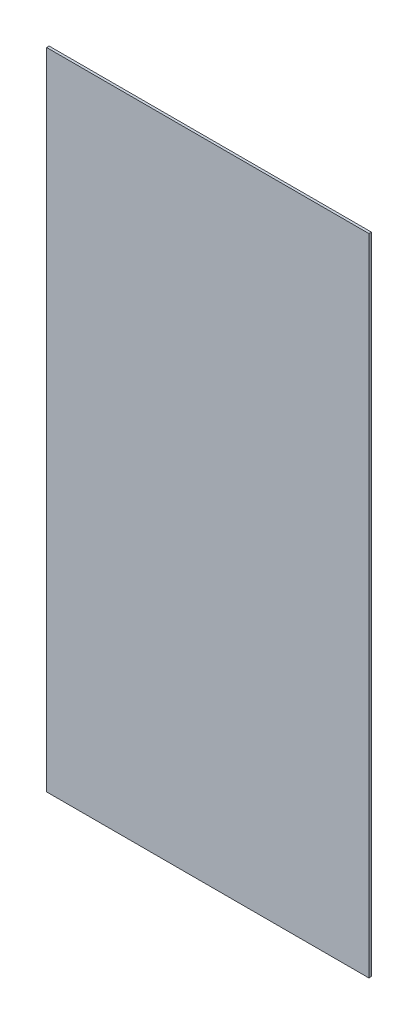
ISO-10303-21;
HEADER;
FILE_DESCRIPTION(('STEP AP214'),'2;1');
FILE_NAME('part.step','',(''),(''),'','','');
FILE_SCHEMA(('AUTOMOTIVE_DESIGN { 1 0 10303 214 1 1 1 1 }'));
ENDSEC;
DATA;
#1=APPLICATION_CONTEXT('core data for automotive mechanical design processes');
#2=APPLICATION_PROTOCOL_DEFINITION('international standard','automotive_design',2000,#1);
#3=PRODUCT_CONTEXT('',#1,'mechanical');
#4=PRODUCT('Part','Part','',(#3));
#5=PRODUCT_RELATED_PRODUCT_CATEGORY('part','',(#4));
#6=PRODUCT_DEFINITION_FORMATION('','',#4);
#7=PRODUCT_DEFINITION_CONTEXT('part definition',#1,'design');
#8=PRODUCT_DEFINITION('design','',#6,#7);
#9=PRODUCT_DEFINITION_SHAPE('','',#8);
#10=(LENGTH_UNIT() NAMED_UNIT(*) SI_UNIT(.MILLI.,.METRE.));
#11=(NAMED_UNIT(*) PLANE_ANGLE_UNIT() SI_UNIT($,.RADIAN.));
#12=(NAMED_UNIT(*) SI_UNIT($,.STERADIAN.) SOLID_ANGLE_UNIT());
#13=UNCERTAINTY_MEASURE_WITH_UNIT(LENGTH_MEASURE(1.E-05),#10,'distance_accuracy_value','');
#14=(GEOMETRIC_REPRESENTATION_CONTEXT(3) GLOBAL_UNCERTAINTY_ASSIGNED_CONTEXT((#13)) GLOBAL_UNIT_ASSIGNED_CONTEXT((#10,
#11,#12)) REPRESENTATION_CONTEXT('',''));
#15=CARTESIAN_POINT('',(0.,0.,0.));
#16=DIRECTION('',(0.,0.,1.));
#17=DIRECTION('',(1.,0.,0.));
#18=AXIS2_PLACEMENT_3D('',#15,#16,#17);
#19=CARTESIAN_POINT('',(25.4,125.4,0.39116));
#20=DIRECTION('',(1.,0.,0.));
#21=DIRECTION('',(0.,0.,-1.));
#22=AXIS2_PLACEMENT_3D('',#19,#20,#21);
#23=PLANE('',#22);
#24=DIRECTION('',(0.,-1.,0.));
#25=VECTOR('',#24,1.);
#26=CARTESIAN_POINT('',(25.4,125.4,0.));
#27=LINE('',#26,#25);
#28=CARTESIAN_POINT('',(25.4,125.4,0.));
#29=VERTEX_POINT('',#28);
#30=CARTESIAN_POINT('',(25.4,25.4,0.));
#31=VERTEX_POINT('',#30);
#32=EDGE_CURVE('E98',#29,#31,#27,.T.);
#33=ORIENTED_EDGE('',*,*,#32,.T.);
#34=DIRECTION('',(0.,0.,-1.));
#35=VECTOR('',#34,1.);
#36=CARTESIAN_POINT('',(25.4,25.4,0.39116));
#37=LINE('',#36,#35);
#38=CARTESIAN_POINT('',(25.4,25.4,0.39116));
#39=VERTEX_POINT('',#38);
#40=EDGE_CURVE('E11',#39,#31,#37,.T.);
#41=ORIENTED_EDGE('',*,*,#40,.F.);
#42=DIRECTION('',(0.,-1.,0.));
#43=VECTOR('',#42,1.);
#44=CARTESIAN_POINT('',(25.4,125.4,0.39116));
#45=LINE('',#44,#43);
#46=CARTESIAN_POINT('',(25.4,125.4,0.39116));
#47=VERTEX_POINT('',#46);
#48=EDGE_CURVE('E86',#47,#39,#45,.T.);
#49=ORIENTED_EDGE('',*,*,#48,.F.);
#50=DIRECTION('',(0.,0.,-1.));
#51=VECTOR('',#50,1.);
#52=CARTESIAN_POINT('',(25.4,125.4,0.39116));
#53=LINE('',#52,#51);
#54=EDGE_CURVE('E94',#47,#29,#53,.T.);
#55=ORIENTED_EDGE('',*,*,#54,.T.);
#56=EDGE_LOOP('',(#33,#41,#49,#55));
#57=FACE_BOUND('',#56,.T.);
#58=ADVANCED_FACE('F35',(#57),#23,.F.);
#59=CARTESIAN_POINT('',(25.4,25.4,0.39116));
#60=DIRECTION('',(0.,1.,0.));
#61=DIRECTION('',(0.,0.,1.));
#62=AXIS2_PLACEMENT_3D('',#59,#60,#61);
#63=PLANE('',#62);
#64=DIRECTION('',(1.,0.,0.));
#65=VECTOR('',#64,1.);
#66=CARTESIAN_POINT('',(25.4,25.4,0.));
#67=LINE('',#66,#65);
#68=CARTESIAN_POINT('',(75.4,25.4,0.));
#69=VERTEX_POINT('',#68);
#70=EDGE_CURVE('E90',#31,#69,#67,.T.);
#71=ORIENTED_EDGE('',*,*,#70,.T.);
#72=DIRECTION('',(0.,0.,-1.));
#73=VECTOR('',#72,1.);
#74=CARTESIAN_POINT('',(75.4,25.4,0.39116));
#75=LINE('',#74,#73);
#76=CARTESIAN_POINT('',(75.4,25.4,0.39116));
#77=VERTEX_POINT('',#76);
#78=EDGE_CURVE('E43',#77,#69,#75,.T.);
#79=ORIENTED_EDGE('',*,*,#78,.F.);
#80=DIRECTION('',(1.,0.,0.));
#81=VECTOR('',#80,1.);
#82=CARTESIAN_POINT('',(25.4,25.4,0.39116));
#83=LINE('',#82,#81);
#84=EDGE_CURVE('E81',#39,#77,#83,.T.);
#85=ORIENTED_EDGE('',*,*,#84,.F.);
#86=ORIENTED_EDGE('',*,*,#40,.T.);
#87=EDGE_LOOP('',(#71,#79,#85,#86));
#88=FACE_BOUND('',#87,.T.);
#89=ADVANCED_FACE('F89',(#88),#63,.F.);
#90=CARTESIAN_POINT('',(75.4,25.4,0.39116));
#91=DIRECTION('',(-1.,0.,0.));
#92=DIRECTION('',(0.,0.,1.));
#93=AXIS2_PLACEMENT_3D('',#90,#91,#92);
#94=PLANE('',#93);
#95=DIRECTION('',(0.,1.,0.));
#96=VECTOR('',#95,1.);
#97=CARTESIAN_POINT('',(75.4,25.4,0.));
#98=LINE('',#97,#96);
#99=CARTESIAN_POINT('',(75.4,125.4,0.));
#100=VERTEX_POINT('',#99);
#101=EDGE_CURVE('E68',#69,#100,#98,.T.);
#102=ORIENTED_EDGE('',*,*,#101,.T.);
#103=DIRECTION('',(0.,0.,-1.));
#104=VECTOR('',#103,1.);
#105=CARTESIAN_POINT('',(75.4,125.4,0.39116));
#106=LINE('',#105,#104);
#107=CARTESIAN_POINT('',(75.4,125.4,0.39116));
#108=VERTEX_POINT('',#107);
#109=EDGE_CURVE('E91',#108,#100,#106,.T.);
#110=ORIENTED_EDGE('',*,*,#109,.F.);
#111=DIRECTION('',(0.,1.,0.));
#112=VECTOR('',#111,1.);
#113=CARTESIAN_POINT('',(75.4,25.4,0.39116));
#114=LINE('',#113,#112);
#115=EDGE_CURVE('E84',#77,#108,#114,.T.);
#116=ORIENTED_EDGE('',*,*,#115,.F.);
#117=ORIENTED_EDGE('',*,*,#78,.T.);
#118=EDGE_LOOP('',(#102,#110,#116,#117));
#119=FACE_BOUND('',#118,.T.);
#120=ADVANCED_FACE('F92',(#119),#94,.F.);
#121=CARTESIAN_POINT('',(75.4,125.4,0.39116));
#122=DIRECTION('',(0.,-1.,0.));
#123=DIRECTION('',(0.,0.,-1.));
#124=AXIS2_PLACEMENT_3D('',#121,#122,#123);
#125=PLANE('',#124);
#126=DIRECTION('',(-1.,0.,0.));
#127=VECTOR('',#126,1.);
#128=CARTESIAN_POINT('',(75.4,125.4,0.));
#129=LINE('',#128,#127);
#130=EDGE_CURVE('E74',#100,#29,#129,.T.);
#131=ORIENTED_EDGE('',*,*,#130,.T.);
#132=ORIENTED_EDGE('',*,*,#54,.F.);
#133=DIRECTION('',(-1.,0.,0.));
#134=VECTOR('',#133,1.);
#135=CARTESIAN_POINT('',(75.4,125.4,0.39116));
#136=LINE('',#135,#134);
#137=EDGE_CURVE('E51',#108,#47,#136,.T.);
#138=ORIENTED_EDGE('',*,*,#137,.F.);
#139=ORIENTED_EDGE('',*,*,#109,.T.);
#140=EDGE_LOOP('',(#131,#132,#138,#139));
#141=FACE_BOUND('',#140,.T.);
#142=ADVANCED_FACE('F105',(#141),#125,.F.);
#143=CARTESIAN_POINT('',(0.,0.,0.39116));
#144=DIRECTION('',(0.,0.,1.));
#145=DIRECTION('',(1.,0.,0.));
#146=AXIS2_PLACEMENT_3D('',#143,#144,#145);
#147=PLANE('',#146);
#148=ORIENTED_EDGE('',*,*,#48,.T.);
#149=ORIENTED_EDGE('',*,*,#84,.T.);
#150=ORIENTED_EDGE('',*,*,#115,.T.);
#151=ORIENTED_EDGE('',*,*,#137,.T.);
#152=EDGE_LOOP('',(#148,#149,#150,#151));
#153=FACE_BOUND('',#152,.T.);
#154=ADVANCED_FACE('F82',(#153),#147,.T.);
#155=CARTESIAN_POINT('',(0.,0.,0.));
#156=DIRECTION('',(0.,0.,1.));
#157=DIRECTION('',(1.,0.,0.));
#158=AXIS2_PLACEMENT_3D('',#155,#156,#157);
#159=PLANE('',#158);
#160=ORIENTED_EDGE('',*,*,#32,.F.);
#161=ORIENTED_EDGE('',*,*,#130,.F.);
#162=ORIENTED_EDGE('',*,*,#101,.F.);
#163=ORIENTED_EDGE('',*,*,#70,.F.);
#164=EDGE_LOOP('',(#160,#161,#162,#163));
#165=FACE_BOUND('',#164,.T.);
#166=ADVANCED_FACE('F108',(#165),#159,.F.);
#167=CLOSED_SHELL('',(#58,#89,#120,#142,#154,#166));
#168=MANIFOLD_SOLID_BREP('B2',#167);
#169=ADVANCED_BREP_SHAPE_REPRESENTATION('',(#18,#168),#14);
#170=SHAPE_DEFINITION_REPRESENTATION(#9,#169);
ENDSEC;
END-ISO-10303-21;
